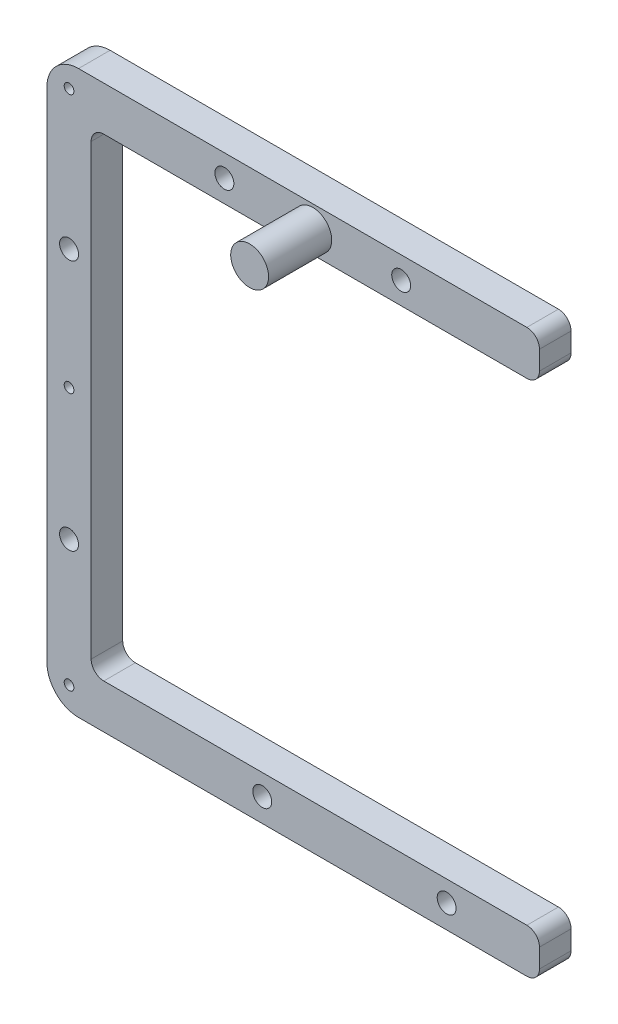
ISO-10303-21;
HEADER;
FILE_DESCRIPTION(('STEP AP214'),'2;1');
FILE_NAME('part.step','',(''),(''),'','','');
FILE_SCHEMA(('AUTOMOTIVE_DESIGN { 1 0 10303 214 1 1 1 1 }'));
ENDSEC;
DATA;
#1=APPLICATION_CONTEXT('core data for automotive mechanical design processes');
#2=APPLICATION_PROTOCOL_DEFINITION('international standard','automotive_design',2000,#1);
#3=PRODUCT_CONTEXT('',#1,'mechanical');
#4=PRODUCT('Part','Part','',(#3));
#5=PRODUCT_RELATED_PRODUCT_CATEGORY('part','',(#4));
#6=PRODUCT_DEFINITION_FORMATION('','',#4);
#7=PRODUCT_DEFINITION_CONTEXT('part definition',#1,'design');
#8=PRODUCT_DEFINITION('design','',#6,#7);
#9=PRODUCT_DEFINITION_SHAPE('','',#8);
#10=(LENGTH_UNIT() NAMED_UNIT(*) SI_UNIT(.MILLI.,.METRE.));
#11=(NAMED_UNIT(*) PLANE_ANGLE_UNIT() SI_UNIT($,.RADIAN.));
#12=(NAMED_UNIT(*) SI_UNIT($,.STERADIAN.) SOLID_ANGLE_UNIT());
#13=UNCERTAINTY_MEASURE_WITH_UNIT(LENGTH_MEASURE(1.E-05),#10,'distance_accuracy_value','');
#14=(GEOMETRIC_REPRESENTATION_CONTEXT(3) GLOBAL_UNCERTAINTY_ASSIGNED_CONTEXT((#13)) GLOBAL_UNIT_ASSIGNED_CONTEXT((#10,
#11,#12)) REPRESENTATION_CONTEXT('',''));
#15=CARTESIAN_POINT('',(0.,0.,0.));
#16=DIRECTION('',(0.,0.,1.));
#17=DIRECTION('',(1.,0.,0.));
#18=AXIS2_PLACEMENT_3D('',#15,#16,#17);
#19=CARTESIAN_POINT('',(-2.00000000000001,-39.5,5.));
#20=DIRECTION('',(0.,0.,-1.));
#21=DIRECTION('',(-1.,0.,0.));
#22=AXIS2_PLACEMENT_3D('',#19,#20,#21);
#23=CYLINDRICAL_SURFACE('',#22,5.);
#24=CARTESIAN_POINT('',(-2.00000000000001,-39.5,0.));
#25=DIRECTION('',(0.,0.,1.));
#26=DIRECTION('',(1.,0.,0.));
#27=AXIS2_PLACEMENT_3D('',#24,#25,#26);
#28=CIRCLE('',#27,5.);
#29=CARTESIAN_POINT('',(-7.00000000000001,-39.5,0.));
#30=VERTEX_POINT('',#29);
#31=CARTESIAN_POINT('',(-1.99999999999998,-44.5,0.));
#32=VERTEX_POINT('',#31);
#33=EDGE_CURVE('E185',#30,#32,#28,.T.);
#34=ORIENTED_EDGE('',*,*,#33,.T.);
#35=DIRECTION('',(0.,0.,-1.));
#36=VECTOR('',#35,1.);
#37=CARTESIAN_POINT('',(-1.99999999999998,-44.5,5.));
#38=LINE('',#37,#36);
#39=CARTESIAN_POINT('',(-1.99999999999998,-44.5,5.));
#40=VERTEX_POINT('',#39);
#41=EDGE_CURVE('E11',#40,#32,#38,.T.);
#42=ORIENTED_EDGE('',*,*,#41,.F.);
#43=CARTESIAN_POINT('',(-2.00000000000001,-39.5,5.));
#44=DIRECTION('',(0.,0.,1.));
#45=DIRECTION('',(1.,0.,0.));
#46=AXIS2_PLACEMENT_3D('',#43,#44,#45);
#47=CIRCLE('',#46,5.);
#48=CARTESIAN_POINT('',(-7.00000000000001,-39.5,5.));
#49=VERTEX_POINT('',#48);
#50=EDGE_CURVE('E216',#49,#40,#47,.T.);
#51=ORIENTED_EDGE('',*,*,#50,.F.);
#52=DIRECTION('',(0.,0.,-1.));
#53=VECTOR('',#52,1.);
#54=CARTESIAN_POINT('',(-7.00000000000001,-39.5,5.));
#55=LINE('',#54,#53);
#56=EDGE_CURVE('E181',#49,#30,#55,.T.);
#57=ORIENTED_EDGE('',*,*,#56,.T.);
#58=EDGE_LOOP('',(#34,#42,#51,#57));
#59=FACE_BOUND('',#58,.T.);
#60=ADVANCED_FACE('F41',(#59),#23,.T.);
#61=CARTESIAN_POINT('',(-1.99999999999998,-44.5,5.));
#62=DIRECTION('',(0.,1.,0.));
#63=DIRECTION('',(0.,0.,1.));
#64=AXIS2_PLACEMENT_3D('',#61,#62,#63);
#65=PLANE('',#64);
#66=DIRECTION('',(1.,0.,0.));
#67=VECTOR('',#66,1.);
#68=CARTESIAN_POINT('',(-1.99999999999998,-44.5,0.));
#69=LINE('',#68,#67);
#70=CARTESIAN_POINT('',(69.,-44.5,0.));
#71=VERTEX_POINT('',#70);
#72=EDGE_CURVE('E188',#32,#71,#69,.T.);
#73=ORIENTED_EDGE('',*,*,#72,.T.);
#74=DIRECTION('',(0.,0.,-1.));
#75=VECTOR('',#74,1.);
#76=CARTESIAN_POINT('',(69.,-44.5,5.));
#77=LINE('',#76,#75);
#78=CARTESIAN_POINT('',(69.,-44.5,5.));
#79=VERTEX_POINT('',#78);
#80=EDGE_CURVE('E49',#79,#71,#77,.T.);
#81=ORIENTED_EDGE('',*,*,#80,.F.);
#82=DIRECTION('',(1.,0.,0.));
#83=VECTOR('',#82,1.);
#84=CARTESIAN_POINT('',(-1.99999999999998,-44.5,5.));
#85=LINE('',#84,#83);
#86=EDGE_CURVE('E124',#40,#79,#85,.T.);
#87=ORIENTED_EDGE('',*,*,#86,.F.);
#88=ORIENTED_EDGE('',*,*,#41,.T.);
#89=EDGE_LOOP('',(#73,#81,#87,#88));
#90=FACE_BOUND('',#89,.T.);
#91=ADVANCED_FACE('F316',(#90),#65,.F.);
#92=CARTESIAN_POINT('',(69.,-42.5,5.));
#93=DIRECTION('',(0.,0.,-1.));
#94=DIRECTION('',(-1.,0.,0.));
#95=AXIS2_PLACEMENT_3D('',#92,#93,#94);
#96=CYLINDRICAL_SURFACE('',#95,2.);
#97=CARTESIAN_POINT('',(69.,-42.5,0.));
#98=DIRECTION('',(0.,0.,1.));
#99=DIRECTION('',(1.,0.,0.));
#100=AXIS2_PLACEMENT_3D('',#97,#98,#99);
#101=CIRCLE('',#100,2.);
#102=CARTESIAN_POINT('',(71.,-42.5,0.));
#103=VERTEX_POINT('',#102);
#104=EDGE_CURVE('E191',#71,#103,#101,.T.);
#105=ORIENTED_EDGE('',*,*,#104,.T.);
#106=DIRECTION('',(0.,0.,-1.));
#107=VECTOR('',#106,1.);
#108=CARTESIAN_POINT('',(71.,-42.5,5.));
#109=LINE('',#108,#107);
#110=CARTESIAN_POINT('',(71.,-42.5,5.));
#111=VERTEX_POINT('',#110);
#112=EDGE_CURVE('E247',#111,#103,#109,.T.);
#113=ORIENTED_EDGE('',*,*,#112,.F.);
#114=CARTESIAN_POINT('',(69.,-42.5,5.));
#115=DIRECTION('',(0.,0.,1.));
#116=DIRECTION('',(1.,0.,0.));
#117=AXIS2_PLACEMENT_3D('',#114,#115,#116);
#118=CIRCLE('',#117,2.);
#119=EDGE_CURVE('E255',#79,#111,#118,.T.);
#120=ORIENTED_EDGE('',*,*,#119,.F.);
#121=ORIENTED_EDGE('',*,*,#80,.T.);
#122=EDGE_LOOP('',(#105,#113,#120,#121));
#123=FACE_BOUND('',#122,.T.);
#124=ADVANCED_FACE('F253',(#123),#96,.T.);
#125=CARTESIAN_POINT('',(71.,-39.5,5.));
#126=DIRECTION('',(-1.,0.,0.));
#127=DIRECTION('',(0.,0.,1.));
#128=AXIS2_PLACEMENT_3D('',#125,#126,#127);
#129=PLANE('',#128);
#130=DIRECTION('',(0.,1.,0.));
#131=VECTOR('',#130,1.);
#132=CARTESIAN_POINT('',(71.,-39.5,0.));
#133=LINE('',#132,#131);
#134=CARTESIAN_POINT('',(71.,-39.5,0.));
#135=VERTEX_POINT('',#134);
#136=EDGE_CURVE('E193',#103,#135,#133,.T.);
#137=ORIENTED_EDGE('',*,*,#136,.T.);
#138=DIRECTION('',(0.,0.,-1.));
#139=VECTOR('',#138,1.);
#140=CARTESIAN_POINT('',(71.,-39.5,5.));
#141=LINE('',#140,#139);
#142=CARTESIAN_POINT('',(71.,-39.5,5.));
#143=VERTEX_POINT('',#142);
#144=EDGE_CURVE('E244',#143,#135,#141,.T.);
#145=ORIENTED_EDGE('',*,*,#144,.F.);
#146=DIRECTION('',(0.,1.,0.));
#147=VECTOR('',#146,1.);
#148=CARTESIAN_POINT('',(71.,-39.5,5.));
#149=LINE('',#148,#147);
#150=EDGE_CURVE('E273',#111,#143,#149,.T.);
#151=ORIENTED_EDGE('',*,*,#150,.F.);
#152=ORIENTED_EDGE('',*,*,#112,.T.);
#153=EDGE_LOOP('',(#137,#145,#151,#152));
#154=FACE_BOUND('',#153,.T.);
#155=ADVANCED_FACE('F264',(#154),#129,.F.);
#156=CARTESIAN_POINT('',(69.,-39.5,5.));
#157=DIRECTION('',(0.,0.,-1.));
#158=DIRECTION('',(-1.,0.,0.));
#159=AXIS2_PLACEMENT_3D('',#156,#157,#158);
#160=CYLINDRICAL_SURFACE('',#159,2.);
#161=CARTESIAN_POINT('',(69.,-39.5,0.));
#162=DIRECTION('',(0.,0.,1.));
#163=DIRECTION('',(-1.,0.,0.));
#164=AXIS2_PLACEMENT_3D('',#161,#162,#163);
#165=CIRCLE('',#164,2.);
#166=CARTESIAN_POINT('',(69.,-37.5,0.));
#167=VERTEX_POINT('',#166);
#168=EDGE_CURVE('E195',#135,#167,#165,.T.);
#169=ORIENTED_EDGE('',*,*,#168,.T.);
#170=DIRECTION('',(0.,0.,-1.));
#171=VECTOR('',#170,1.);
#172=CARTESIAN_POINT('',(69.,-37.5,5.));
#173=LINE('',#172,#171);
#174=CARTESIAN_POINT('',(69.,-37.5,5.));
#175=VERTEX_POINT('',#174);
#176=EDGE_CURVE('E241',#175,#167,#173,.T.);
#177=ORIENTED_EDGE('',*,*,#176,.F.);
#178=CARTESIAN_POINT('',(69.,-39.5,5.));
#179=DIRECTION('',(0.,0.,1.));
#180=DIRECTION('',(-1.,0.,0.));
#181=AXIS2_PLACEMENT_3D('',#178,#179,#180);
#182=CIRCLE('',#181,2.);
#183=EDGE_CURVE('E270',#143,#175,#182,.T.);
#184=ORIENTED_EDGE('',*,*,#183,.F.);
#185=ORIENTED_EDGE('',*,*,#144,.T.);
#186=EDGE_LOOP('',(#169,#177,#184,#185));
#187=FACE_BOUND('',#186,.T.);
#188=ADVANCED_FACE('F268',(#187),#160,.T.);
#189=CARTESIAN_POINT('',(2.00000000000002,-37.5,5.));
#190=DIRECTION('',(0.,-1.,0.));
#191=DIRECTION('',(0.,0.,-1.));
#192=AXIS2_PLACEMENT_3D('',#189,#190,#191);
#193=PLANE('',#192);
#194=DIRECTION('',(-1.,0.,0.));
#195=VECTOR('',#194,1.);
#196=CARTESIAN_POINT('',(2.00000000000002,-37.5,0.));
#197=LINE('',#196,#195);
#198=CARTESIAN_POINT('',(2.00000000000002,-37.5,0.));
#199=VERTEX_POINT('',#198);
#200=EDGE_CURVE('E197',#167,#199,#197,.T.);
#201=ORIENTED_EDGE('',*,*,#200,.T.);
#202=DIRECTION('',(0.,0.,-1.));
#203=VECTOR('',#202,1.);
#204=CARTESIAN_POINT('',(2.00000000000002,-37.5,5.));
#205=LINE('',#204,#203);
#206=CARTESIAN_POINT('',(2.00000000000002,-37.5,5.));
#207=VERTEX_POINT('',#206);
#208=EDGE_CURVE('E238',#207,#199,#205,.T.);
#209=ORIENTED_EDGE('',*,*,#208,.F.);
#210=DIRECTION('',(-1.,0.,0.));
#211=VECTOR('',#210,1.);
#212=CARTESIAN_POINT('',(2.00000000000002,-37.5,5.));
#213=LINE('',#212,#211);
#214=EDGE_CURVE('E272',#175,#207,#213,.T.);
#215=ORIENTED_EDGE('',*,*,#214,.F.);
#216=ORIENTED_EDGE('',*,*,#176,.T.);
#217=EDGE_LOOP('',(#201,#209,#215,#216));
#218=FACE_BOUND('',#217,.T.);
#219=ADVANCED_FACE('F329',(#218),#193,.F.);
#220=CARTESIAN_POINT('',(2.00000000000001,-35.5,5.));
#221=DIRECTION('',(0.,0.,-1.));
#222=DIRECTION('',(-1.,0.,0.));
#223=AXIS2_PLACEMENT_3D('',#220,#221,#222);
#224=CYLINDRICAL_SURFACE('',#223,2.);
#225=CARTESIAN_POINT('',(2.00000000000001,-35.5,0.));
#226=DIRECTION('',(0.,0.,-1.));
#227=DIRECTION('',(1.,0.,0.));
#228=AXIS2_PLACEMENT_3D('',#225,#226,#227);
#229=CIRCLE('',#228,2.);
#230=CARTESIAN_POINT('',(0.,-35.5,0.));
#231=VERTEX_POINT('',#230);
#232=EDGE_CURVE('E199',#199,#231,#229,.T.);
#233=ORIENTED_EDGE('',*,*,#232,.T.);
#234=DIRECTION('',(0.,0.,-1.));
#235=VECTOR('',#234,1.);
#236=CARTESIAN_POINT('',(0.,-35.5,5.));
#237=LINE('',#236,#235);
#238=CARTESIAN_POINT('',(0.,-35.5,5.));
#239=VERTEX_POINT('',#238);
#240=EDGE_CURVE('E235',#239,#231,#237,.T.);
#241=ORIENTED_EDGE('',*,*,#240,.F.);
#242=CARTESIAN_POINT('',(2.00000000000001,-35.5,5.));
#243=DIRECTION('',(0.,0.,-1.));
#244=DIRECTION('',(1.,0.,0.));
#245=AXIS2_PLACEMENT_3D('',#242,#243,#244);
#246=CIRCLE('',#245,2.);
#247=EDGE_CURVE('E275',#207,#239,#246,.T.);
#248=ORIENTED_EDGE('',*,*,#247,.F.);
#249=ORIENTED_EDGE('',*,*,#208,.T.);
#250=EDGE_LOOP('',(#233,#241,#248,#249));
#251=FACE_BOUND('',#250,.T.);
#252=ADVANCED_FACE('F332',(#251),#224,.F.);
#253=CARTESIAN_POINT('',(0.,35.5,5.));
#254=DIRECTION('',(-1.,0.,0.));
#255=DIRECTION('',(0.,-1.,0.));
#256=AXIS2_PLACEMENT_3D('',#253,#254,#255);
#257=PLANE('',#256);
#258=DIRECTION('',(0.,1.,0.));
#259=VECTOR('',#258,1.);
#260=CARTESIAN_POINT('',(0.,35.5,0.));
#261=LINE('',#260,#259);
#262=CARTESIAN_POINT('',(0.,35.5,0.));
#263=VERTEX_POINT('',#262);
#264=EDGE_CURVE('E201',#231,#263,#261,.T.);
#265=ORIENTED_EDGE('',*,*,#264,.T.);
#266=DIRECTION('',(0.,0.,-1.));
#267=VECTOR('',#266,1.);
#268=CARTESIAN_POINT('',(0.,35.5,5.));
#269=LINE('',#268,#267);
#270=CARTESIAN_POINT('',(0.,35.5,5.));
#271=VERTEX_POINT('',#270);
#272=EDGE_CURVE('E232',#271,#263,#269,.T.);
#273=ORIENTED_EDGE('',*,*,#272,.F.);
#274=DIRECTION('',(0.,1.,0.));
#275=VECTOR('',#274,1.);
#276=CARTESIAN_POINT('',(0.,35.5,5.));
#277=LINE('',#276,#275);
#278=EDGE_CURVE('E281',#239,#271,#277,.T.);
#279=ORIENTED_EDGE('',*,*,#278,.F.);
#280=ORIENTED_EDGE('',*,*,#240,.T.);
#281=EDGE_LOOP('',(#265,#273,#279,#280));
#282=FACE_BOUND('',#281,.T.);
#283=ADVANCED_FACE('F336',(#282),#257,.F.);
#284=CARTESIAN_POINT('',(1.99999999999999,35.5,5.));
#285=DIRECTION('',(0.,0.,-1.));
#286=DIRECTION('',(-1.,0.,0.));
#287=AXIS2_PLACEMENT_3D('',#284,#285,#286);
#288=CYLINDRICAL_SURFACE('',#287,2.);
#289=CARTESIAN_POINT('',(1.99999999999999,35.5,0.));
#290=DIRECTION('',(0.,0.,-1.));
#291=DIRECTION('',(-1.,0.,0.));
#292=AXIS2_PLACEMENT_3D('',#289,#290,#291);
#293=CIRCLE('',#292,2.);
#294=CARTESIAN_POINT('',(2.,37.5,0.));
#295=VERTEX_POINT('',#294);
#296=EDGE_CURVE('E203',#263,#295,#293,.T.);
#297=ORIENTED_EDGE('',*,*,#296,.T.);
#298=DIRECTION('',(0.,0.,-1.));
#299=VECTOR('',#298,1.);
#300=CARTESIAN_POINT('',(2.,37.5,5.));
#301=LINE('',#300,#299);
#302=CARTESIAN_POINT('',(2.,37.5,5.));
#303=VERTEX_POINT('',#302);
#304=EDGE_CURVE('E229',#303,#295,#301,.T.);
#305=ORIENTED_EDGE('',*,*,#304,.F.);
#306=CARTESIAN_POINT('',(1.99999999999999,35.5,5.));
#307=DIRECTION('',(0.,0.,-1.));
#308=DIRECTION('',(-1.,0.,0.));
#309=AXIS2_PLACEMENT_3D('',#306,#307,#308);
#310=CIRCLE('',#309,2.);
#311=EDGE_CURVE('E283',#271,#303,#310,.T.);
#312=ORIENTED_EDGE('',*,*,#311,.F.);
#313=ORIENTED_EDGE('',*,*,#272,.T.);
#314=EDGE_LOOP('',(#297,#305,#312,#313));
#315=FACE_BOUND('',#314,.T.);
#316=ADVANCED_FACE('F340',(#315),#288,.F.);
#317=CARTESIAN_POINT('',(2.,37.5,5.));
#318=DIRECTION('',(0.,1.,0.));
#319=DIRECTION('',(0.,0.,1.));
#320=AXIS2_PLACEMENT_3D('',#317,#318,#319);
#321=PLANE('',#320);
#322=DIRECTION('',(1.,0.,0.));
#323=VECTOR('',#322,1.);
#324=CARTESIAN_POINT('',(2.,37.5,0.));
#325=LINE('',#324,#323);
#326=CARTESIAN_POINT('',(69.,37.5,0.));
#327=VERTEX_POINT('',#326);
#328=EDGE_CURVE('E205',#295,#327,#325,.T.);
#329=ORIENTED_EDGE('',*,*,#328,.T.);
#330=DIRECTION('',(0.,0.,-1.));
#331=VECTOR('',#330,1.);
#332=CARTESIAN_POINT('',(69.,37.5,5.));
#333=LINE('',#332,#331);
#334=CARTESIAN_POINT('',(69.,37.5,5.));
#335=VERTEX_POINT('',#334);
#336=EDGE_CURVE('E226',#335,#327,#333,.T.);
#337=ORIENTED_EDGE('',*,*,#336,.F.);
#338=DIRECTION('',(1.,0.,0.));
#339=VECTOR('',#338,1.);
#340=CARTESIAN_POINT('',(2.,37.5,5.));
#341=LINE('',#340,#339);
#342=EDGE_CURVE('E285',#303,#335,#341,.T.);
#343=ORIENTED_EDGE('',*,*,#342,.F.);
#344=ORIENTED_EDGE('',*,*,#304,.T.);
#345=EDGE_LOOP('',(#329,#337,#343,#344));
#346=FACE_BOUND('',#345,.T.);
#347=ADVANCED_FACE('F344',(#346),#321,.F.);
#348=CARTESIAN_POINT('',(69.,39.5,5.));
#349=DIRECTION('',(0.,0.,-1.));
#350=DIRECTION('',(-1.,0.,0.));
#351=AXIS2_PLACEMENT_3D('',#348,#349,#350);
#352=CYLINDRICAL_SURFACE('',#351,2.);
#353=CARTESIAN_POINT('',(69.,39.5,0.));
#354=DIRECTION('',(0.,0.,1.));
#355=DIRECTION('',(1.,0.,0.));
#356=AXIS2_PLACEMENT_3D('',#353,#354,#355);
#357=CIRCLE('',#356,2.);
#358=CARTESIAN_POINT('',(71.,39.5,0.));
#359=VERTEX_POINT('',#358);
#360=EDGE_CURVE('E207',#327,#359,#357,.T.);
#361=ORIENTED_EDGE('',*,*,#360,.T.);
#362=DIRECTION('',(0.,0.,-1.));
#363=VECTOR('',#362,1.);
#364=CARTESIAN_POINT('',(71.,39.5,5.));
#365=LINE('',#364,#363);
#366=CARTESIAN_POINT('',(71.,39.5,5.));
#367=VERTEX_POINT('',#366);
#368=EDGE_CURVE('E223',#367,#359,#365,.T.);
#369=ORIENTED_EDGE('',*,*,#368,.F.);
#370=CARTESIAN_POINT('',(69.,39.5,5.));
#371=DIRECTION('',(0.,0.,1.));
#372=DIRECTION('',(1.,0.,0.));
#373=AXIS2_PLACEMENT_3D('',#370,#371,#372);
#374=CIRCLE('',#373,2.);
#375=EDGE_CURVE('E287',#335,#367,#374,.T.);
#376=ORIENTED_EDGE('',*,*,#375,.F.);
#377=ORIENTED_EDGE('',*,*,#336,.T.);
#378=EDGE_LOOP('',(#361,#369,#376,#377));
#379=FACE_BOUND('',#378,.T.);
#380=ADVANCED_FACE('F348',(#379),#352,.T.);
#381=CARTESIAN_POINT('',(71.,42.5,5.));
#382=DIRECTION('',(-1.,0.,0.));
#383=DIRECTION('',(0.,0.,1.));
#384=AXIS2_PLACEMENT_3D('',#381,#382,#383);
#385=PLANE('',#384);
#386=DIRECTION('',(0.,1.,0.));
#387=VECTOR('',#386,1.);
#388=CARTESIAN_POINT('',(71.,42.5,0.));
#389=LINE('',#388,#387);
#390=CARTESIAN_POINT('',(71.,42.5,0.));
#391=VERTEX_POINT('',#390);
#392=EDGE_CURVE('E209',#359,#391,#389,.T.);
#393=ORIENTED_EDGE('',*,*,#392,.T.);
#394=DIRECTION('',(0.,0.,-1.));
#395=VECTOR('',#394,1.);
#396=CARTESIAN_POINT('',(71.,42.5,5.));
#397=LINE('',#396,#395);
#398=CARTESIAN_POINT('',(71.,42.5,5.));
#399=VERTEX_POINT('',#398);
#400=EDGE_CURVE('E220',#399,#391,#397,.T.);
#401=ORIENTED_EDGE('',*,*,#400,.F.);
#402=DIRECTION('',(0.,1.,0.));
#403=VECTOR('',#402,1.);
#404=CARTESIAN_POINT('',(71.,42.5,5.));
#405=LINE('',#404,#403);
#406=EDGE_CURVE('E289',#367,#399,#405,.T.);
#407=ORIENTED_EDGE('',*,*,#406,.F.);
#408=ORIENTED_EDGE('',*,*,#368,.T.);
#409=EDGE_LOOP('',(#393,#401,#407,#408));
#410=FACE_BOUND('',#409,.T.);
#411=ADVANCED_FACE('F295',(#410),#385,.F.);
#412=CARTESIAN_POINT('',(69.,42.5,5.));
#413=DIRECTION('',(0.,0.,-1.));
#414=DIRECTION('',(-1.,0.,0.));
#415=AXIS2_PLACEMENT_3D('',#412,#413,#414);
#416=CYLINDRICAL_SURFACE('',#415,2.);
#417=CARTESIAN_POINT('',(69.,42.5,0.));
#418=DIRECTION('',(0.,0.,1.));
#419=DIRECTION('',(-1.,0.,0.));
#420=AXIS2_PLACEMENT_3D('',#417,#418,#419);
#421=CIRCLE('',#420,2.);
#422=CARTESIAN_POINT('',(69.,44.5,0.));
#423=VERTEX_POINT('',#422);
#424=EDGE_CURVE('E211',#391,#423,#421,.T.);
#425=ORIENTED_EDGE('',*,*,#424,.T.);
#426=DIRECTION('',(0.,0.,-1.));
#427=VECTOR('',#426,1.);
#428=CARTESIAN_POINT('',(69.,44.5,5.));
#429=LINE('',#428,#427);
#430=CARTESIAN_POINT('',(69.,44.5,5.));
#431=VERTEX_POINT('',#430);
#432=EDGE_CURVE('E176',#431,#423,#429,.T.);
#433=ORIENTED_EDGE('',*,*,#432,.F.);
#434=CARTESIAN_POINT('',(69.,42.5,5.));
#435=DIRECTION('',(0.,0.,1.));
#436=DIRECTION('',(-1.,0.,0.));
#437=AXIS2_PLACEMENT_3D('',#434,#435,#436);
#438=CIRCLE('',#437,2.);
#439=EDGE_CURVE('E167',#399,#431,#438,.T.);
#440=ORIENTED_EDGE('',*,*,#439,.F.);
#441=ORIENTED_EDGE('',*,*,#400,.T.);
#442=EDGE_LOOP('',(#425,#433,#440,#441));
#443=FACE_BOUND('',#442,.T.);
#444=ADVANCED_FACE('F299',(#443),#416,.T.);
#445=CARTESIAN_POINT('',(-1.99999999999998,44.5,5.));
#446=DIRECTION('',(0.,-1.,0.));
#447=DIRECTION('',(0.,0.,-1.));
#448=AXIS2_PLACEMENT_3D('',#445,#446,#447);
#449=PLANE('',#448);
#450=DIRECTION('',(-1.,0.,0.));
#451=VECTOR('',#450,1.);
#452=CARTESIAN_POINT('',(-1.99999999999998,44.5,0.));
#453=LINE('',#452,#451);
#454=CARTESIAN_POINT('',(-1.99999999999998,44.5,0.));
#455=VERTEX_POINT('',#454);
#456=EDGE_CURVE('E175',#423,#455,#453,.T.);
#457=ORIENTED_EDGE('',*,*,#456,.T.);
#458=DIRECTION('',(0.,0.,-1.));
#459=VECTOR('',#458,1.);
#460=CARTESIAN_POINT('',(-1.99999999999998,44.5,5.));
#461=LINE('',#460,#459);
#462=CARTESIAN_POINT('',(-1.99999999999998,44.5,5.));
#463=VERTEX_POINT('',#462);
#464=EDGE_CURVE('E172',#463,#455,#461,.T.);
#465=ORIENTED_EDGE('',*,*,#464,.F.);
#466=DIRECTION('',(-1.,0.,0.));
#467=VECTOR('',#466,1.);
#468=CARTESIAN_POINT('',(-1.99999999999998,44.5,5.));
#469=LINE('',#468,#467);
#470=EDGE_CURVE('E161',#431,#463,#469,.T.);
#471=ORIENTED_EDGE('',*,*,#470,.F.);
#472=ORIENTED_EDGE('',*,*,#432,.T.);
#473=EDGE_LOOP('',(#457,#465,#471,#472));
#474=FACE_BOUND('',#473,.T.);
#475=ADVANCED_FACE('F173',(#474),#449,.F.);
#476=CARTESIAN_POINT('',(-2.00000000000001,39.5,5.));
#477=DIRECTION('',(0.,0.,-1.));
#478=DIRECTION('',(-1.,0.,0.));
#479=AXIS2_PLACEMENT_3D('',#476,#477,#478);
#480=CYLINDRICAL_SURFACE('',#479,5.);
#481=CARTESIAN_POINT('',(-2.00000000000001,39.5,0.));
#482=DIRECTION('',(0.,0.,1.));
#483=DIRECTION('',(1.,0.,0.));
#484=AXIS2_PLACEMENT_3D('',#481,#482,#483);
#485=CIRCLE('',#484,5.);
#486=CARTESIAN_POINT('',(-7.00000000000001,39.5,0.));
#487=VERTEX_POINT('',#486);
#488=EDGE_CURVE('E110',#455,#487,#485,.T.);
#489=ORIENTED_EDGE('',*,*,#488,.T.);
#490=DIRECTION('',(0.,0.,-1.));
#491=VECTOR('',#490,1.);
#492=CARTESIAN_POINT('',(-7.00000000000001,39.5,5.));
#493=LINE('',#492,#491);
#494=CARTESIAN_POINT('',(-7.00000000000001,39.5,5.));
#495=VERTEX_POINT('',#494);
#496=EDGE_CURVE('E177',#495,#487,#493,.T.);
#497=ORIENTED_EDGE('',*,*,#496,.F.);
#498=CARTESIAN_POINT('',(-2.00000000000001,39.5,5.));
#499=DIRECTION('',(0.,0.,1.));
#500=DIRECTION('',(1.,0.,0.));
#501=AXIS2_PLACEMENT_3D('',#498,#499,#500);
#502=CIRCLE('',#501,5.);
#503=EDGE_CURVE('E165',#463,#495,#502,.T.);
#504=ORIENTED_EDGE('',*,*,#503,.F.);
#505=ORIENTED_EDGE('',*,*,#464,.T.);
#506=EDGE_LOOP('',(#489,#497,#504,#505));
#507=FACE_BOUND('',#506,.T.);
#508=ADVANCED_FACE('F179',(#507),#480,.T.);
#509=CARTESIAN_POINT('',(-7.00000000000001,39.5,5.));
#510=DIRECTION('',(1.,0.,0.));
#511=DIRECTION('',(0.,0.,-1.));
#512=AXIS2_PLACEMENT_3D('',#509,#510,#511);
#513=PLANE('',#512);
#514=DIRECTION('',(0.,-1.,0.));
#515=VECTOR('',#514,1.);
#516=CARTESIAN_POINT('',(-7.00000000000001,39.5,0.));
#517=LINE('',#516,#515);
#518=EDGE_CURVE('E116',#487,#30,#517,.T.);
#519=ORIENTED_EDGE('',*,*,#518,.T.);
#520=ORIENTED_EDGE('',*,*,#56,.F.);
#521=DIRECTION('',(0.,-1.,0.));
#522=VECTOR('',#521,1.);
#523=CARTESIAN_POINT('',(-7.00000000000001,39.5,5.));
#524=LINE('',#523,#522);
#525=EDGE_CURVE('E57',#495,#49,#524,.T.);
#526=ORIENTED_EDGE('',*,*,#525,.F.);
#527=ORIENTED_EDGE('',*,*,#496,.T.);
#528=EDGE_LOOP('',(#519,#520,#526,#527));
#529=FACE_BOUND('',#528,.T.);
#530=ADVANCED_FACE('F303',(#529),#513,.F.);
#531=CARTESIAN_POINT('',(-2.00000000000001,-39.5,5.));
#532=DIRECTION('',(0.,0.,1.));
#533=DIRECTION('',(1.,0.,0.));
#534=AXIS2_PLACEMENT_3D('',#531,#532,#533);
#535=PLANE('',#534);
#536=CARTESIAN_POINT('',(-3.5,-40.8,5.));
#537=DIRECTION('',(0.,0.,1.));
#538=DIRECTION('',(1.,0.,0.));
#539=AXIS2_PLACEMENT_3D('',#536,#537,#538);
#540=CIRCLE('',#539,0.77);
#541=CARTESIAN_POINT('',(-2.73,-40.8,5.));
#542=VERTEX_POINT('',#541);
#543=EDGE_CURVE('E685',#542,#542,#540,.T.);
#544=ORIENTED_EDGE('',*,*,#543,.F.);
#545=EDGE_LOOP('',(#544));
#546=FACE_BOUND('',#545,.T.);
#547=CARTESIAN_POINT('',(-3.50000000000001,41.,5.));
#548=DIRECTION('',(0.,0.,1.));
#549=DIRECTION('',(1.,0.,0.));
#550=AXIS2_PLACEMENT_3D('',#547,#548,#549);
#551=CIRCLE('',#550,0.77);
#552=CARTESIAN_POINT('',(-2.73000000000001,41.,5.));
#553=VERTEX_POINT('',#552);
#554=EDGE_CURVE('E699',#553,#553,#551,.T.);
#555=ORIENTED_EDGE('',*,*,#554,.F.);
#556=EDGE_LOOP('',(#555));
#557=FACE_BOUND('',#556,.T.);
#558=CARTESIAN_POINT('',(-3.50000000000001,0.,5.));
#559=DIRECTION('',(0.,0.,1.));
#560=DIRECTION('',(1.,0.,0.));
#561=AXIS2_PLACEMENT_3D('',#558,#559,#560);
#562=CIRCLE('',#561,0.77);
#563=CARTESIAN_POINT('',(-2.73000000000001,0.,5.));
#564=VERTEX_POINT('',#563);
#565=EDGE_CURVE('E696',#564,#564,#562,.T.);
#566=ORIENTED_EDGE('',*,*,#565,.F.);
#567=EDGE_LOOP('',(#566));
#568=FACE_BOUND('',#567,.T.);
#569=CARTESIAN_POINT('',(56.3,-40.8,5.));
#570=DIRECTION('',(0.,0.,1.));
#571=DIRECTION('',(1.,0.,0.));
#572=AXIS2_PLACEMENT_3D('',#569,#570,#571);
#573=CIRCLE('',#572,1.5);
#574=CARTESIAN_POINT('',(57.8,-40.8,5.));
#575=VERTEX_POINT('',#574);
#576=EDGE_CURVE('E725',#575,#575,#573,.T.);
#577=ORIENTED_EDGE('',*,*,#576,.F.);
#578=EDGE_LOOP('',(#577));
#579=FACE_BOUND('',#578,.T.);
#580=CARTESIAN_POINT('',(27.1,-40.8,5.));
#581=DIRECTION('',(0.,0.,1.));
#582=DIRECTION('',(1.,0.,0.));
#583=AXIS2_PLACEMENT_3D('',#580,#581,#582);
#584=CIRCLE('',#583,1.5);
#585=CARTESIAN_POINT('',(28.6,-40.8,5.));
#586=VERTEX_POINT('',#585);
#587=EDGE_CURVE('E719',#586,#586,#584,.T.);
#588=ORIENTED_EDGE('',*,*,#587,.F.);
#589=EDGE_LOOP('',(#588));
#590=FACE_BOUND('',#589,.T.);
#591=CARTESIAN_POINT('',(-3.50000000000001,-20.8,5.));
#592=DIRECTION('',(0.,0.,1.));
#593=DIRECTION('',(1.,0.,0.));
#594=AXIS2_PLACEMENT_3D('',#591,#592,#593);
#595=CIRCLE('',#594,1.5);
#596=CARTESIAN_POINT('',(-2.,-20.8,5.));
#597=VERTEX_POINT('',#596);
#598=EDGE_CURVE('E713',#597,#597,#595,.T.);
#599=ORIENTED_EDGE('',*,*,#598,.F.);
#600=EDGE_LOOP('',(#599));
#601=FACE_BOUND('',#600,.T.);
#602=CARTESIAN_POINT('',(-3.50000000000001,19.,5.));
#603=DIRECTION('',(0.,0.,1.));
#604=DIRECTION('',(1.,0.,0.));
#605=AXIS2_PLACEMENT_3D('',#602,#603,#604);
#606=CIRCLE('',#605,1.5);
#607=CARTESIAN_POINT('',(-2.00000000000001,19.,5.));
#608=VERTEX_POINT('',#607);
#609=EDGE_CURVE('E707',#608,#608,#606,.T.);
#610=ORIENTED_EDGE('',*,*,#609,.F.);
#611=EDGE_LOOP('',(#610));
#612=FACE_BOUND('',#611,.T.);
#613=CARTESIAN_POINT('',(21.1,41.,5.));
#614=DIRECTION('',(0.,0.,1.));
#615=DIRECTION('',(1.,0.,0.));
#616=AXIS2_PLACEMENT_3D('',#613,#614,#615);
#617=CIRCLE('',#616,1.5);
#618=CARTESIAN_POINT('',(22.6,41.,5.));
#619=VERTEX_POINT('',#618);
#620=EDGE_CURVE('E700',#619,#619,#617,.T.);
#621=ORIENTED_EDGE('',*,*,#620,.F.);
#622=EDGE_LOOP('',(#621));
#623=FACE_BOUND('',#622,.T.);
#624=CARTESIAN_POINT('',(49.1,41.,5.));
#625=DIRECTION('',(0.,0.,1.));
#626=DIRECTION('',(1.,0.,0.));
#627=AXIS2_PLACEMENT_3D('',#624,#625,#626);
#628=CIRCLE('',#627,1.5);
#629=CARTESIAN_POINT('',(50.6,41.,5.));
#630=VERTEX_POINT('',#629);
#631=EDGE_CURVE('E703',#630,#630,#628,.T.);
#632=ORIENTED_EDGE('',*,*,#631,.F.);
#633=EDGE_LOOP('',(#632));
#634=FACE_BOUND('',#633,.T.);
#635=CARTESIAN_POINT('',(35.1,41.,5.));
#636=DIRECTION('',(0.,0.,1.));
#637=DIRECTION('',(1.,0.,0.));
#638=AXIS2_PLACEMENT_3D('',#635,#636,#637);
#639=CIRCLE('',#638,3.);
#640=CARTESIAN_POINT('',(38.1,41.,5.));
#641=VERTEX_POINT('',#640);
#642=EDGE_CURVE('E733',#641,#641,#639,.T.);
#643=ORIENTED_EDGE('',*,*,#642,.F.);
#644=EDGE_LOOP('',(#643));
#645=FACE_BOUND('',#644,.T.);
#646=ORIENTED_EDGE('',*,*,#50,.T.);
#647=ORIENTED_EDGE('',*,*,#86,.T.);
#648=ORIENTED_EDGE('',*,*,#119,.T.);
#649=ORIENTED_EDGE('',*,*,#150,.T.);
#650=ORIENTED_EDGE('',*,*,#183,.T.);
#651=ORIENTED_EDGE('',*,*,#214,.T.);
#652=ORIENTED_EDGE('',*,*,#247,.T.);
#653=ORIENTED_EDGE('',*,*,#278,.T.);
#654=ORIENTED_EDGE('',*,*,#311,.T.);
#655=ORIENTED_EDGE('',*,*,#342,.T.);
#656=ORIENTED_EDGE('',*,*,#375,.T.);
#657=ORIENTED_EDGE('',*,*,#406,.T.);
#658=ORIENTED_EDGE('',*,*,#439,.T.);
#659=ORIENTED_EDGE('',*,*,#470,.T.);
#660=ORIENTED_EDGE('',*,*,#503,.T.);
#661=ORIENTED_EDGE('',*,*,#525,.T.);
#662=EDGE_LOOP('',(#646,#647,#648,#649,#650,#651,#652,#653,#654,#655,#656,#657,#658,#659,#660,#661));
#663=FACE_BOUND('',#662,.T.);
#664=ADVANCED_FACE('F163',(#546,#557,#568,#579,#590,#601,#612,#623,#634,#645,#663),#535,.T.);
#665=CARTESIAN_POINT('',(-2.00000000000001,-39.5,0.));
#666=DIRECTION('',(0.,0.,1.));
#667=DIRECTION('',(1.,0.,0.));
#668=AXIS2_PLACEMENT_3D('',#665,#666,#667);
#669=PLANE('',#668);
#670=CARTESIAN_POINT('',(56.3,-40.8,0.));
#671=DIRECTION('',(0.,0.,1.));
#672=DIRECTION('',(1.,0.,0.));
#673=AXIS2_PLACEMENT_3D('',#670,#671,#672);
#674=CIRCLE('',#673,1.5);
#675=CARTESIAN_POINT('',(57.8,-40.8,0.));
#676=VERTEX_POINT('',#675);
#677=EDGE_CURVE('E695',#676,#676,#674,.T.);
#678=ORIENTED_EDGE('',*,*,#677,.T.);
#679=EDGE_LOOP('',(#678));
#680=FACE_BOUND('',#679,.T.);
#681=CARTESIAN_POINT('',(27.1,-40.8,0.));
#682=DIRECTION('',(0.,0.,1.));
#683=DIRECTION('',(1.,0.,0.));
#684=AXIS2_PLACEMENT_3D('',#681,#682,#683);
#685=CIRCLE('',#684,1.5);
#686=CARTESIAN_POINT('',(28.6,-40.8,0.));
#687=VERTEX_POINT('',#686);
#688=EDGE_CURVE('E722',#687,#687,#685,.T.);
#689=ORIENTED_EDGE('',*,*,#688,.T.);
#690=EDGE_LOOP('',(#689));
#691=FACE_BOUND('',#690,.T.);
#692=CARTESIAN_POINT('',(-3.50000000000001,-20.8,0.));
#693=DIRECTION('',(0.,0.,1.));
#694=DIRECTION('',(1.,0.,0.));
#695=AXIS2_PLACEMENT_3D('',#692,#693,#694);
#696=CIRCLE('',#695,1.5);
#697=CARTESIAN_POINT('',(-2.,-20.8,0.));
#698=VERTEX_POINT('',#697);
#699=EDGE_CURVE('E716',#698,#698,#696,.T.);
#700=ORIENTED_EDGE('',*,*,#699,.T.);
#701=EDGE_LOOP('',(#700));
#702=FACE_BOUND('',#701,.T.);
#703=CARTESIAN_POINT('',(-3.50000000000001,19.,0.));
#704=DIRECTION('',(0.,0.,1.));
#705=DIRECTION('',(1.,0.,0.));
#706=AXIS2_PLACEMENT_3D('',#703,#704,#705);
#707=CIRCLE('',#706,1.5);
#708=CARTESIAN_POINT('',(-2.00000000000001,19.,0.));
#709=VERTEX_POINT('',#708);
#710=EDGE_CURVE('E710',#709,#709,#707,.T.);
#711=ORIENTED_EDGE('',*,*,#710,.T.);
#712=EDGE_LOOP('',(#711));
#713=FACE_BOUND('',#712,.T.);
#714=CARTESIAN_POINT('',(21.1,41.,0.));
#715=DIRECTION('',(0.,0.,1.));
#716=DIRECTION('',(1.,0.,0.));
#717=AXIS2_PLACEMENT_3D('',#714,#715,#716);
#718=CIRCLE('',#717,1.5);
#719=CARTESIAN_POINT('',(22.6,41.,0.));
#720=VERTEX_POINT('',#719);
#721=EDGE_CURVE('E704',#720,#720,#718,.T.);
#722=ORIENTED_EDGE('',*,*,#721,.T.);
#723=EDGE_LOOP('',(#722));
#724=FACE_BOUND('',#723,.T.);
#725=CARTESIAN_POINT('',(49.1,41.,0.));
#726=DIRECTION('',(0.,0.,1.));
#727=DIRECTION('',(1.,0.,0.));
#728=AXIS2_PLACEMENT_3D('',#725,#726,#727);
#729=CIRCLE('',#728,1.5);
#730=CARTESIAN_POINT('',(50.6,41.,0.));
#731=VERTEX_POINT('',#730);
#732=EDGE_CURVE('E730',#731,#731,#729,.T.);
#733=ORIENTED_EDGE('',*,*,#732,.T.);
#734=EDGE_LOOP('',(#733));
#735=FACE_BOUND('',#734,.T.);
#736=ORIENTED_EDGE('',*,*,#33,.F.);
#737=ORIENTED_EDGE('',*,*,#518,.F.);
#738=ORIENTED_EDGE('',*,*,#488,.F.);
#739=ORIENTED_EDGE('',*,*,#456,.F.);
#740=ORIENTED_EDGE('',*,*,#424,.F.);
#741=ORIENTED_EDGE('',*,*,#392,.F.);
#742=ORIENTED_EDGE('',*,*,#360,.F.);
#743=ORIENTED_EDGE('',*,*,#328,.F.);
#744=ORIENTED_EDGE('',*,*,#296,.F.);
#745=ORIENTED_EDGE('',*,*,#264,.F.);
#746=ORIENTED_EDGE('',*,*,#232,.F.);
#747=ORIENTED_EDGE('',*,*,#200,.F.);
#748=ORIENTED_EDGE('',*,*,#168,.F.);
#749=ORIENTED_EDGE('',*,*,#136,.F.);
#750=ORIENTED_EDGE('',*,*,#104,.F.);
#751=ORIENTED_EDGE('',*,*,#72,.F.);
#752=EDGE_LOOP('',(#736,#737,#738,#739,#740,#741,#742,#743,#744,#745,#746,#747,#748,#749,#750,#751));
#753=FACE_BOUND('',#752,.T.);
#754=ADVANCED_FACE('F259',(#680,#691,#702,#713,#724,#735,#753),#669,.F.);
#755=CARTESIAN_POINT('',(35.1,41.,15.));
#756=DIRECTION('',(0.,0.,-1.));
#757=DIRECTION('',(-1.,0.,0.));
#758=AXIS2_PLACEMENT_3D('',#755,#756,#757);
#759=CYLINDRICAL_SURFACE('',#758,3.);
#760=CARTESIAN_POINT('',(35.1,41.,15.));
#761=DIRECTION('',(0.,0.,1.));
#762=DIRECTION('',(1.,0.,0.));
#763=AXIS2_PLACEMENT_3D('',#760,#761,#762);
#764=CIRCLE('',#763,3.);
#765=CARTESIAN_POINT('',(38.1,41.,15.));
#766=VERTEX_POINT('',#765);
#767=EDGE_CURVE('E189',#766,#766,#764,.T.);
#768=ORIENTED_EDGE('',*,*,#767,.F.);
#769=EDGE_LOOP('',(#768));
#770=FACE_BOUND('',#769,.T.);
#771=ORIENTED_EDGE('',*,*,#642,.T.);
#772=EDGE_LOOP('',(#771));
#773=FACE_BOUND('',#772,.T.);
#774=ADVANCED_FACE('F378',(#770,#773),#759,.T.);
#775=CARTESIAN_POINT('',(35.1,41.,15.));
#776=DIRECTION('',(0.,0.,1.));
#777=DIRECTION('',(1.,0.,0.));
#778=AXIS2_PLACEMENT_3D('',#775,#776,#777);
#779=PLANE('',#778);
#780=ORIENTED_EDGE('',*,*,#767,.T.);
#781=EDGE_LOOP('',(#780));
#782=FACE_BOUND('',#781,.T.);
#783=ADVANCED_FACE('F383',(#782),#779,.T.);
#784=CARTESIAN_POINT('',(49.1,41.,0.));
#785=DIRECTION('',(0.,0.,1.));
#786=DIRECTION('',(1.,0.,0.));
#787=AXIS2_PLACEMENT_3D('',#784,#785,#786);
#788=CYLINDRICAL_SURFACE('',#787,1.5);
#789=ORIENTED_EDGE('',*,*,#732,.F.);
#790=EDGE_LOOP('',(#789));
#791=FACE_BOUND('',#790,.T.);
#792=ORIENTED_EDGE('',*,*,#631,.T.);
#793=EDGE_LOOP('',(#792));
#794=FACE_BOUND('',#793,.T.);
#795=ADVANCED_FACE('F396',(#791,#794),#788,.F.);
#796=CARTESIAN_POINT('',(21.1,41.,0.));
#797=DIRECTION('',(0.,0.,1.));
#798=DIRECTION('',(1.,0.,0.));
#799=AXIS2_PLACEMENT_3D('',#796,#797,#798);
#800=CYLINDRICAL_SURFACE('',#799,1.5);
#801=ORIENTED_EDGE('',*,*,#721,.F.);
#802=EDGE_LOOP('',(#801));
#803=FACE_BOUND('',#802,.T.);
#804=ORIENTED_EDGE('',*,*,#620,.T.);
#805=EDGE_LOOP('',(#804));
#806=FACE_BOUND('',#805,.T.);
#807=ADVANCED_FACE('F411',(#803,#806),#800,.F.);
#808=CARTESIAN_POINT('',(-3.50000000000001,19.,0.));
#809=DIRECTION('',(0.,0.,1.));
#810=DIRECTION('',(1.,0.,0.));
#811=AXIS2_PLACEMENT_3D('',#808,#809,#810);
#812=CYLINDRICAL_SURFACE('',#811,1.5);
#813=ORIENTED_EDGE('',*,*,#710,.F.);
#814=EDGE_LOOP('',(#813));
#815=FACE_BOUND('',#814,.T.);
#816=ORIENTED_EDGE('',*,*,#609,.T.);
#817=EDGE_LOOP('',(#816));
#818=FACE_BOUND('',#817,.T.);
#819=ADVANCED_FACE('F422',(#815,#818),#812,.F.);
#820=CARTESIAN_POINT('',(-3.50000000000001,-20.8,0.));
#821=DIRECTION('',(0.,0.,1.));
#822=DIRECTION('',(1.,0.,0.));
#823=AXIS2_PLACEMENT_3D('',#820,#821,#822);
#824=CYLINDRICAL_SURFACE('',#823,1.5);
#825=ORIENTED_EDGE('',*,*,#699,.F.);
#826=EDGE_LOOP('',(#825));
#827=FACE_BOUND('',#826,.T.);
#828=ORIENTED_EDGE('',*,*,#598,.T.);
#829=EDGE_LOOP('',(#828));
#830=FACE_BOUND('',#829,.T.);
#831=ADVANCED_FACE('F433',(#827,#830),#824,.F.);
#832=CARTESIAN_POINT('',(27.1,-40.8,0.));
#833=DIRECTION('',(0.,0.,1.));
#834=DIRECTION('',(1.,0.,0.));
#835=AXIS2_PLACEMENT_3D('',#832,#833,#834);
#836=CYLINDRICAL_SURFACE('',#835,1.5);
#837=ORIENTED_EDGE('',*,*,#688,.F.);
#838=EDGE_LOOP('',(#837));
#839=FACE_BOUND('',#838,.T.);
#840=ORIENTED_EDGE('',*,*,#587,.T.);
#841=EDGE_LOOP('',(#840));
#842=FACE_BOUND('',#841,.T.);
#843=ADVANCED_FACE('F444',(#839,#842),#836,.F.);
#844=CARTESIAN_POINT('',(56.3,-40.8,0.));
#845=DIRECTION('',(0.,0.,1.));
#846=DIRECTION('',(1.,0.,0.));
#847=AXIS2_PLACEMENT_3D('',#844,#845,#846);
#848=CYLINDRICAL_SURFACE('',#847,1.5);
#849=ORIENTED_EDGE('',*,*,#677,.F.);
#850=EDGE_LOOP('',(#849));
#851=FACE_BOUND('',#850,.T.);
#852=ORIENTED_EDGE('',*,*,#576,.T.);
#853=EDGE_LOOP('',(#852));
#854=FACE_BOUND('',#853,.T.);
#855=ADVANCED_FACE('F455',(#851,#854),#848,.F.);
#856=CARTESIAN_POINT('',(-3.50000000000001,0.,2.));
#857=DIRECTION('',(0.,0.,1.));
#858=DIRECTION('',(1.,0.,0.));
#859=AXIS2_PLACEMENT_3D('',#856,#857,#858);
#860=CYLINDRICAL_SURFACE('',#859,0.77);
#861=CARTESIAN_POINT('',(-3.50000000000001,0.,2.));
#862=DIRECTION('',(0.,0.,1.));
#863=DIRECTION('',(1.,0.,0.));
#864=AXIS2_PLACEMENT_3D('',#861,#862,#863);
#865=CIRCLE('',#864,0.77);
#866=CARTESIAN_POINT('',(-2.73000000000001,0.,2.));
#867=VERTEX_POINT('',#866);
#868=EDGE_CURVE('E692',#867,#867,#865,.T.);
#869=ORIENTED_EDGE('',*,*,#868,.F.);
#870=EDGE_LOOP('',(#869));
#871=FACE_BOUND('',#870,.T.);
#872=ORIENTED_EDGE('',*,*,#565,.T.);
#873=EDGE_LOOP('',(#872));
#874=FACE_BOUND('',#873,.T.);
#875=ADVANCED_FACE('F466',(#871,#874),#860,.F.);
#876=CARTESIAN_POINT('',(-3.50000000000001,0.,2.));
#877=DIRECTION('',(0.,0.,1.));
#878=DIRECTION('',(1.,0.,0.));
#879=AXIS2_PLACEMENT_3D('',#876,#877,#878);
#880=PLANE('',#879);
#881=ORIENTED_EDGE('',*,*,#868,.T.);
#882=EDGE_LOOP('',(#881));
#883=FACE_BOUND('',#882,.T.);
#884=ADVANCED_FACE('F484',(#883),#880,.T.);
#885=CARTESIAN_POINT('',(-3.50000000000001,41.,2.));
#886=DIRECTION('',(0.,0.,1.));
#887=DIRECTION('',(1.,0.,0.));
#888=AXIS2_PLACEMENT_3D('',#885,#886,#887);
#889=CYLINDRICAL_SURFACE('',#888,0.77);
#890=CARTESIAN_POINT('',(-3.50000000000001,41.,2.));
#891=DIRECTION('',(0.,0.,1.));
#892=DIRECTION('',(1.,0.,0.));
#893=AXIS2_PLACEMENT_3D('',#890,#891,#892);
#894=CIRCLE('',#893,0.77);
#895=CARTESIAN_POINT('',(-2.73000000000001,41.,2.));
#896=VERTEX_POINT('',#895);
#897=EDGE_CURVE('E688',#896,#896,#894,.T.);
#898=ORIENTED_EDGE('',*,*,#897,.F.);
#899=EDGE_LOOP('',(#898));
#900=FACE_BOUND('',#899,.T.);
#901=ORIENTED_EDGE('',*,*,#554,.T.);
#902=EDGE_LOOP('',(#901));
#903=FACE_BOUND('',#902,.T.);
#904=ADVANCED_FACE('F496',(#900,#903),#889,.F.);
#905=CARTESIAN_POINT('',(-3.50000000000001,41.,2.));
#906=DIRECTION('',(0.,0.,1.));
#907=DIRECTION('',(1.,0.,0.));
#908=AXIS2_PLACEMENT_3D('',#905,#906,#907);
#909=PLANE('',#908);
#910=ORIENTED_EDGE('',*,*,#897,.T.);
#911=EDGE_LOOP('',(#910));
#912=FACE_BOUND('',#911,.T.);
#913=ADVANCED_FACE('F507',(#912),#909,.T.);
#914=CARTESIAN_POINT('',(-3.5,-40.8,2.));
#915=DIRECTION('',(0.,0.,1.));
#916=DIRECTION('',(1.,0.,0.));
#917=AXIS2_PLACEMENT_3D('',#914,#915,#916);
#918=CYLINDRICAL_SURFACE('',#917,0.77);
#919=CARTESIAN_POINT('',(-3.5,-40.8,2.));
#920=DIRECTION('',(0.,0.,1.));
#921=DIRECTION('',(1.,0.,0.));
#922=AXIS2_PLACEMENT_3D('',#919,#920,#921);
#923=CIRCLE('',#922,0.77);
#924=CARTESIAN_POINT('',(-2.73,-40.8,2.));
#925=VERTEX_POINT('',#924);
#926=EDGE_CURVE('E684',#925,#925,#923,.T.);
#927=ORIENTED_EDGE('',*,*,#926,.F.);
#928=EDGE_LOOP('',(#927));
#929=FACE_BOUND('',#928,.T.);
#930=ORIENTED_EDGE('',*,*,#543,.T.);
#931=EDGE_LOOP('',(#930));
#932=FACE_BOUND('',#931,.T.);
#933=ADVANCED_FACE('F520',(#929,#932),#918,.F.);
#934=CARTESIAN_POINT('',(-3.5,-40.8,2.));
#935=DIRECTION('',(0.,0.,1.));
#936=DIRECTION('',(1.,0.,0.));
#937=AXIS2_PLACEMENT_3D('',#934,#935,#936);
#938=PLANE('',#937);
#939=ORIENTED_EDGE('',*,*,#926,.T.);
#940=EDGE_LOOP('',(#939));
#941=FACE_BOUND('',#940,.T.);
#942=ADVANCED_FACE('F532',(#941),#938,.T.);
#943=CLOSED_SHELL('',(#60,#91,#124,#155,#188,#219,#252,#283,#316,#347,#380,#411,#444,#475,#508,
#530,#664,#754,#774,#783,#795,#807,#819,#831,#843,#855,#875,#884,#904,#913,#933,#942));
#944=MANIFOLD_SOLID_BREP('B2',#943);
#945=ADVANCED_BREP_SHAPE_REPRESENTATION('',(#18,#944),#14);
#946=SHAPE_DEFINITION_REPRESENTATION(#9,#945);
ENDSEC;
END-ISO-10303-21;
